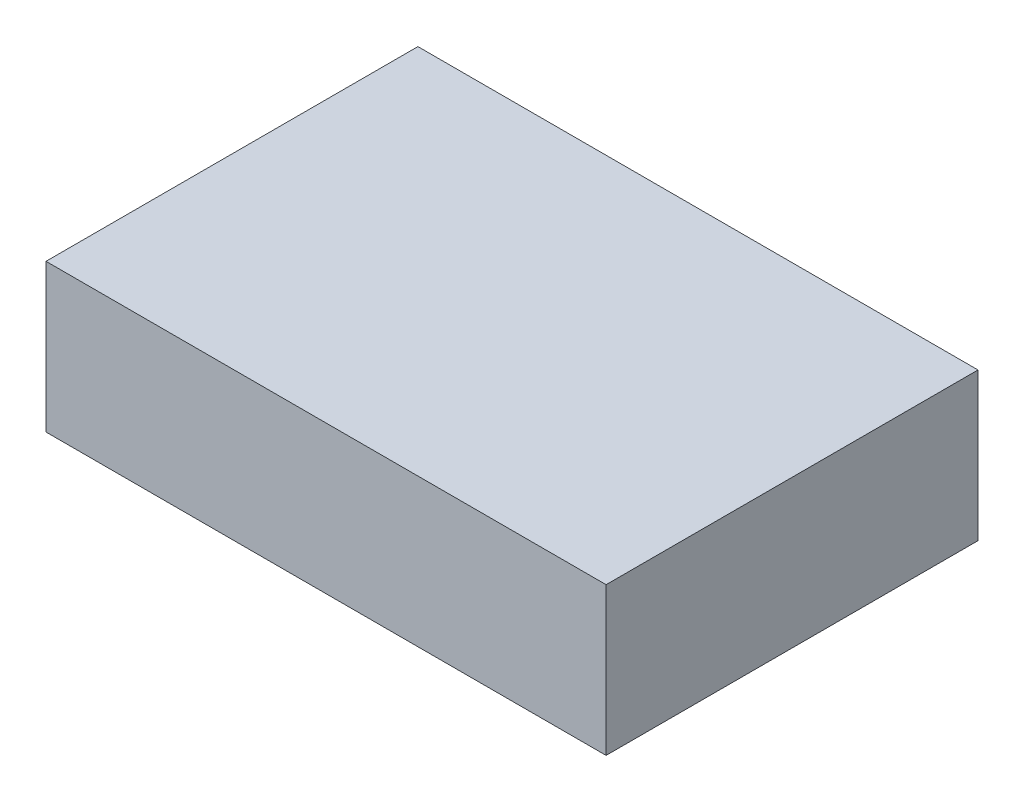
ISO-10303-21;
HEADER;
FILE_DESCRIPTION(('STEP AP214'),'2;1');
FILE_NAME('part.step','',(''),(''),'','','');
FILE_SCHEMA(('AUTOMOTIVE_DESIGN { 1 0 10303 214 1 1 1 1 }'));
ENDSEC;
DATA;
#1=APPLICATION_CONTEXT('core data for automotive mechanical design processes');
#2=APPLICATION_PROTOCOL_DEFINITION('international standard','automotive_design',2000,#1);
#3=PRODUCT_CONTEXT('',#1,'mechanical');
#4=PRODUCT('Part','Part','',(#3));
#5=PRODUCT_RELATED_PRODUCT_CATEGORY('part','',(#4));
#6=PRODUCT_DEFINITION_FORMATION('','',#4);
#7=PRODUCT_DEFINITION_CONTEXT('part definition',#1,'design');
#8=PRODUCT_DEFINITION('design','',#6,#7);
#9=PRODUCT_DEFINITION_SHAPE('','',#8);
#10=(LENGTH_UNIT() NAMED_UNIT(*) SI_UNIT(.MILLI.,.METRE.));
#11=(NAMED_UNIT(*) PLANE_ANGLE_UNIT() SI_UNIT($,.RADIAN.));
#12=(NAMED_UNIT(*) SI_UNIT($,.STERADIAN.) SOLID_ANGLE_UNIT());
#13=UNCERTAINTY_MEASURE_WITH_UNIT(LENGTH_MEASURE(1.E-05),#10,'distance_accuracy_value','');
#14=(GEOMETRIC_REPRESENTATION_CONTEXT(3) GLOBAL_UNCERTAINTY_ASSIGNED_CONTEXT((#13)) GLOBAL_UNIT_ASSIGNED_CONTEXT((#10,
#11,#12)) REPRESENTATION_CONTEXT('',''));
#15=CARTESIAN_POINT('',(0.,0.,0.));
#16=DIRECTION('',(0.,0.,1.));
#17=DIRECTION('',(1.,0.,0.));
#18=AXIS2_PLACEMENT_3D('',#15,#16,#17);
#19=CARTESIAN_POINT('',(62.5,33.,41.5));
#20=DIRECTION('',(-1.,0.,0.));
#21=DIRECTION('',(0.,0.,1.));
#22=AXIS2_PLACEMENT_3D('',#19,#20,#21);
#23=PLANE('',#22);
#24=DIRECTION('',(0.,0.,-1.));
#25=VECTOR('',#24,1.);
#26=CARTESIAN_POINT('',(62.5,0.,41.5));
#27=LINE('',#26,#25);
#28=CARTESIAN_POINT('',(62.5,0.,41.5));
#29=VERTEX_POINT('',#28);
#30=CARTESIAN_POINT('',(62.5,0.,-41.5));
#31=VERTEX_POINT('',#30);
#32=EDGE_CURVE('E98',#29,#31,#27,.T.);
#33=ORIENTED_EDGE('',*,*,#32,.T.);
#34=DIRECTION('',(0.,-1.,0.));
#35=VECTOR('',#34,1.);
#36=CARTESIAN_POINT('',(62.5,33.,-41.5));
#37=LINE('',#36,#35);
#38=CARTESIAN_POINT('',(62.5,33.,-41.5));
#39=VERTEX_POINT('',#38);
#40=EDGE_CURVE('E11',#39,#31,#37,.T.);
#41=ORIENTED_EDGE('',*,*,#40,.F.);
#42=DIRECTION('',(0.,0.,-1.));
#43=VECTOR('',#42,1.);
#44=CARTESIAN_POINT('',(62.5,33.,41.5));
#45=LINE('',#44,#43);
#46=CARTESIAN_POINT('',(62.5,33.,41.5));
#47=VERTEX_POINT('',#46);
#48=EDGE_CURVE('E86',#47,#39,#45,.T.);
#49=ORIENTED_EDGE('',*,*,#48,.F.);
#50=DIRECTION('',(0.,-1.,0.));
#51=VECTOR('',#50,1.);
#52=CARTESIAN_POINT('',(62.5,33.,41.5));
#53=LINE('',#52,#51);
#54=EDGE_CURVE('E94',#47,#29,#53,.T.);
#55=ORIENTED_EDGE('',*,*,#54,.T.);
#56=EDGE_LOOP('',(#33,#41,#49,#55));
#57=FACE_BOUND('',#56,.T.);
#58=ADVANCED_FACE('F35',(#57),#23,.F.);
#59=CARTESIAN_POINT('',(-62.5,33.,-41.5));
#60=DIRECTION('',(0.,0.,1.));
#61=DIRECTION('',(1.,0.,0.));
#62=AXIS2_PLACEMENT_3D('',#59,#60,#61);
#63=PLANE('',#62);
#64=DIRECTION('',(-1.,0.,0.));
#65=VECTOR('',#64,1.);
#66=CARTESIAN_POINT('',(-62.5,0.,-41.5));
#67=LINE('',#66,#65);
#68=CARTESIAN_POINT('',(-62.5,0.,-41.5));
#69=VERTEX_POINT('',#68);
#70=EDGE_CURVE('E90',#31,#69,#67,.T.);
#71=ORIENTED_EDGE('',*,*,#70,.T.);
#72=DIRECTION('',(0.,-1.,0.));
#73=VECTOR('',#72,1.);
#74=CARTESIAN_POINT('',(-62.5,33.,-41.5));
#75=LINE('',#74,#73);
#76=CARTESIAN_POINT('',(-62.5,33.,-41.5));
#77=VERTEX_POINT('',#76);
#78=EDGE_CURVE('E43',#77,#69,#75,.T.);
#79=ORIENTED_EDGE('',*,*,#78,.F.);
#80=DIRECTION('',(-1.,0.,0.));
#81=VECTOR('',#80,1.);
#82=CARTESIAN_POINT('',(-62.5,33.,-41.5));
#83=LINE('',#82,#81);
#84=EDGE_CURVE('E81',#39,#77,#83,.T.);
#85=ORIENTED_EDGE('',*,*,#84,.F.);
#86=ORIENTED_EDGE('',*,*,#40,.T.);
#87=EDGE_LOOP('',(#71,#79,#85,#86));
#88=FACE_BOUND('',#87,.T.);
#89=ADVANCED_FACE('F89',(#88),#63,.F.);
#90=CARTESIAN_POINT('',(-62.5,33.,41.5));
#91=DIRECTION('',(1.,0.,0.));
#92=DIRECTION('',(0.,0.,-1.));
#93=AXIS2_PLACEMENT_3D('',#90,#91,#92);
#94=PLANE('',#93);
#95=DIRECTION('',(0.,0.,1.));
#96=VECTOR('',#95,1.);
#97=CARTESIAN_POINT('',(-62.5,0.,41.5));
#98=LINE('',#97,#96);
#99=CARTESIAN_POINT('',(-62.5,0.,41.5));
#100=VERTEX_POINT('',#99);
#101=EDGE_CURVE('E68',#69,#100,#98,.T.);
#102=ORIENTED_EDGE('',*,*,#101,.T.);
#103=DIRECTION('',(0.,-1.,0.));
#104=VECTOR('',#103,1.);
#105=CARTESIAN_POINT('',(-62.5,33.,41.5));
#106=LINE('',#105,#104);
#107=CARTESIAN_POINT('',(-62.5,33.,41.5));
#108=VERTEX_POINT('',#107);
#109=EDGE_CURVE('E91',#108,#100,#106,.T.);
#110=ORIENTED_EDGE('',*,*,#109,.F.);
#111=DIRECTION('',(0.,0.,1.));
#112=VECTOR('',#111,1.);
#113=CARTESIAN_POINT('',(-62.5,33.,41.5));
#114=LINE('',#113,#112);
#115=EDGE_CURVE('E84',#77,#108,#114,.T.);
#116=ORIENTED_EDGE('',*,*,#115,.F.);
#117=ORIENTED_EDGE('',*,*,#78,.T.);
#118=EDGE_LOOP('',(#102,#110,#116,#117));
#119=FACE_BOUND('',#118,.T.);
#120=ADVANCED_FACE('F92',(#119),#94,.F.);
#121=CARTESIAN_POINT('',(-62.5,33.,41.5));
#122=DIRECTION('',(0.,0.,-1.));
#123=DIRECTION('',(-1.,0.,0.));
#124=AXIS2_PLACEMENT_3D('',#121,#122,#123);
#125=PLANE('',#124);
#126=DIRECTION('',(1.,0.,0.));
#127=VECTOR('',#126,1.);
#128=CARTESIAN_POINT('',(-62.5,0.,41.5));
#129=LINE('',#128,#127);
#130=EDGE_CURVE('E74',#100,#29,#129,.T.);
#131=ORIENTED_EDGE('',*,*,#130,.T.);
#132=ORIENTED_EDGE('',*,*,#54,.F.);
#133=DIRECTION('',(1.,0.,0.));
#134=VECTOR('',#133,1.);
#135=CARTESIAN_POINT('',(-62.5,33.,41.5));
#136=LINE('',#135,#134);
#137=EDGE_CURVE('E51',#108,#47,#136,.T.);
#138=ORIENTED_EDGE('',*,*,#137,.F.);
#139=ORIENTED_EDGE('',*,*,#109,.T.);
#140=EDGE_LOOP('',(#131,#132,#138,#139));
#141=FACE_BOUND('',#140,.T.);
#142=ADVANCED_FACE('F105',(#141),#125,.F.);
#143=CARTESIAN_POINT('',(0.,33.,0.));
#144=DIRECTION('',(0.,-1.,0.));
#145=DIRECTION('',(0.,0.,-1.));
#146=AXIS2_PLACEMENT_3D('',#143,#144,#145);
#147=PLANE('',#146);
#148=ORIENTED_EDGE('',*,*,#48,.T.);
#149=ORIENTED_EDGE('',*,*,#84,.T.);
#150=ORIENTED_EDGE('',*,*,#115,.T.);
#151=ORIENTED_EDGE('',*,*,#137,.T.);
#152=EDGE_LOOP('',(#148,#149,#150,#151));
#153=FACE_BOUND('',#152,.T.);
#154=ADVANCED_FACE('F82',(#153),#147,.F.);
#155=CARTESIAN_POINT('',(0.,0.,0.));
#156=DIRECTION('',(0.,-1.,0.));
#157=DIRECTION('',(0.,0.,-1.));
#158=AXIS2_PLACEMENT_3D('',#155,#156,#157);
#159=PLANE('',#158);
#160=ORIENTED_EDGE('',*,*,#32,.F.);
#161=ORIENTED_EDGE('',*,*,#130,.F.);
#162=ORIENTED_EDGE('',*,*,#101,.F.);
#163=ORIENTED_EDGE('',*,*,#70,.F.);
#164=EDGE_LOOP('',(#160,#161,#162,#163));
#165=FACE_BOUND('',#164,.T.);
#166=ADVANCED_FACE('F108',(#165),#159,.T.);
#167=CLOSED_SHELL('',(#58,#89,#120,#142,#154,#166));
#168=MANIFOLD_SOLID_BREP('B2',#167);
#169=ADVANCED_BREP_SHAPE_REPRESENTATION('',(#18,#168),#14);
#170=SHAPE_DEFINITION_REPRESENTATION(#9,#169);
ENDSEC;
END-ISO-10303-21;
